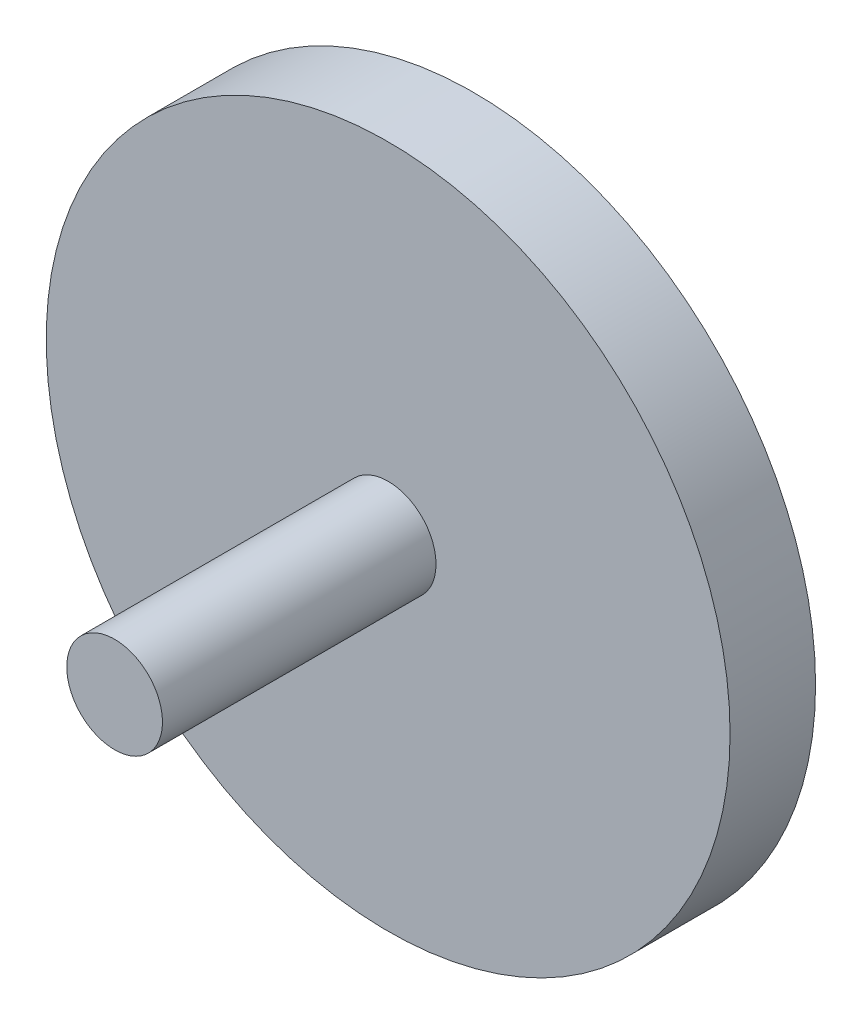
ISO-10303-21;
HEADER;
FILE_DESCRIPTION(('STEP AP214'),'2;1');
FILE_NAME('part.step','',(''),(''),'','','');
FILE_SCHEMA(('AUTOMOTIVE_DESIGN { 1 0 10303 214 1 1 1 1 }'));
ENDSEC;
DATA;
#1=APPLICATION_CONTEXT('core data for automotive mechanical design processes');
#2=APPLICATION_PROTOCOL_DEFINITION('international standard','automotive_design',2000,#1);
#3=PRODUCT_CONTEXT('',#1,'mechanical');
#4=PRODUCT('Part','Part','',(#3));
#5=PRODUCT_RELATED_PRODUCT_CATEGORY('part','',(#4));
#6=PRODUCT_DEFINITION_FORMATION('','',#4);
#7=PRODUCT_DEFINITION_CONTEXT('part definition',#1,'design');
#8=PRODUCT_DEFINITION('design','',#6,#7);
#9=PRODUCT_DEFINITION_SHAPE('','',#8);
#10=(LENGTH_UNIT() NAMED_UNIT(*) SI_UNIT(.MILLI.,.METRE.));
#11=(NAMED_UNIT(*) PLANE_ANGLE_UNIT() SI_UNIT($,.RADIAN.));
#12=(NAMED_UNIT(*) SI_UNIT($,.STERADIAN.) SOLID_ANGLE_UNIT());
#13=UNCERTAINTY_MEASURE_WITH_UNIT(LENGTH_MEASURE(1.E-05),#10,'distance_accuracy_value','');
#14=(GEOMETRIC_REPRESENTATION_CONTEXT(3) GLOBAL_UNCERTAINTY_ASSIGNED_CONTEXT((#13)) GLOBAL_UNIT_ASSIGNED_CONTEXT((#10,
#11,#12)) REPRESENTATION_CONTEXT('',''));
#15=CARTESIAN_POINT('',(0.,0.,0.));
#16=DIRECTION('',(0.,0.,1.));
#17=DIRECTION('',(1.,0.,0.));
#18=AXIS2_PLACEMENT_3D('',#15,#16,#17);
#19=CARTESIAN_POINT('',(0.,0.,25.));
#20=DIRECTION('',(0.,0.,-1.));
#21=DIRECTION('',(-1.,0.,0.));
#22=AXIS2_PLACEMENT_3D('',#19,#20,#21);
#23=CYLINDRICAL_SURFACE('',#22,100.);
#24=CARTESIAN_POINT('',(0.,0.,25.));
#25=DIRECTION('',(0.,0.,1.));
#26=DIRECTION('',(1.,0.,0.));
#27=AXIS2_PLACEMENT_3D('',#24,#25,#26);
#28=CIRCLE('',#27,100.);
#29=CARTESIAN_POINT('',(100.,0.,25.));
#30=VERTEX_POINT('',#29);
#31=EDGE_CURVE('E10',#30,#30,#28,.T.);
#32=ORIENTED_EDGE('',*,*,#31,.F.);
#33=EDGE_LOOP('',(#32));
#34=FACE_BOUND('',#33,.T.);
#35=CARTESIAN_POINT('',(0.,0.,0.));
#36=DIRECTION('',(0.,0.,1.));
#37=DIRECTION('',(1.,0.,0.));
#38=AXIS2_PLACEMENT_3D('',#35,#36,#37);
#39=CIRCLE('',#38,100.);
#40=CARTESIAN_POINT('',(100.,0.,0.));
#41=VERTEX_POINT('',#40);
#42=EDGE_CURVE('E40',#41,#41,#39,.T.);
#43=ORIENTED_EDGE('',*,*,#42,.T.);
#44=EDGE_LOOP('',(#43));
#45=FACE_BOUND('',#44,.T.);
#46=ADVANCED_FACE('F37',(#34,#45),#23,.T.);
#47=CARTESIAN_POINT('',(0.,0.,25.));
#48=DIRECTION('',(0.,0.,1.));
#49=DIRECTION('',(1.,0.,0.));
#50=AXIS2_PLACEMENT_3D('',#47,#48,#49);
#51=PLANE('',#50);
#52=CARTESIAN_POINT('',(0.,0.,25.));
#53=DIRECTION('',(0.,0.,1.));
#54=DIRECTION('',(1.,0.,0.));
#55=AXIS2_PLACEMENT_3D('',#52,#53,#54);
#56=CIRCLE('',#55,14.);
#57=CARTESIAN_POINT('',(14.,0.,25.));
#58=VERTEX_POINT('',#57);
#59=EDGE_CURVE('E51',#58,#58,#56,.T.);
#60=ORIENTED_EDGE('',*,*,#59,.F.);
#61=EDGE_LOOP('',(#60));
#62=FACE_BOUND('',#61,.T.);
#63=ORIENTED_EDGE('',*,*,#31,.T.);
#64=EDGE_LOOP('',(#63));
#65=FACE_BOUND('',#64,.T.);
#66=ADVANCED_FACE('F80',(#62,#65),#51,.T.);
#67=CARTESIAN_POINT('',(0.,0.,0.));
#68=DIRECTION('',(0.,0.,1.));
#69=DIRECTION('',(1.,0.,0.));
#70=AXIS2_PLACEMENT_3D('',#67,#68,#69);
#71=PLANE('',#70);
#72=CARTESIAN_POINT('',(0.,50.,0.));
#73=DIRECTION('',(0.,0.,-1.));
#74=DIRECTION('',(-1.,0.,0.));
#75=AXIS2_PLACEMENT_3D('',#72,#73,#74);
#76=CIRCLE('',#75,10.);
#77=CARTESIAN_POINT('',(-10.,50.,0.));
#78=VERTEX_POINT('',#77);
#79=EDGE_CURVE('E59',#78,#78,#76,.T.);
#80=ORIENTED_EDGE('',*,*,#79,.F.);
#81=EDGE_LOOP('',(#80));
#82=FACE_BOUND('',#81,.T.);
#83=ORIENTED_EDGE('',*,*,#42,.F.);
#84=EDGE_LOOP('',(#83));
#85=FACE_BOUND('',#84,.T.);
#86=ADVANCED_FACE('F76',(#82,#85),#71,.F.);
#87=CARTESIAN_POINT('',(0.,0.,105.));
#88=DIRECTION('',(0.,0.,-1.));
#89=DIRECTION('',(-1.,0.,0.));
#90=AXIS2_PLACEMENT_3D('',#87,#88,#89);
#91=CYLINDRICAL_SURFACE('',#90,14.);
#92=CARTESIAN_POINT('',(0.,0.,105.));
#93=DIRECTION('',(0.,0.,1.));
#94=DIRECTION('',(1.,0.,0.));
#95=AXIS2_PLACEMENT_3D('',#92,#93,#94);
#96=CIRCLE('',#95,14.);
#97=CARTESIAN_POINT('',(14.,0.,105.));
#98=VERTEX_POINT('',#97);
#99=EDGE_CURVE('E49',#98,#98,#96,.T.);
#100=ORIENTED_EDGE('',*,*,#99,.F.);
#101=EDGE_LOOP('',(#100));
#102=FACE_BOUND('',#101,.T.);
#103=ORIENTED_EDGE('',*,*,#59,.T.);
#104=EDGE_LOOP('',(#103));
#105=FACE_BOUND('',#104,.T.);
#106=ADVANCED_FACE('F79',(#102,#105),#91,.T.);
#107=CARTESIAN_POINT('',(0.,0.,105.));
#108=DIRECTION('',(0.,0.,1.));
#109=DIRECTION('',(1.,0.,0.));
#110=AXIS2_PLACEMENT_3D('',#107,#108,#109);
#111=PLANE('',#110);
#112=ORIENTED_EDGE('',*,*,#99,.T.);
#113=EDGE_LOOP('',(#112));
#114=FACE_BOUND('',#113,.T.);
#115=ADVANCED_FACE('F72',(#114),#111,.T.);
#116=CARTESIAN_POINT('',(0.,50.,4.));
#117=DIRECTION('',(0.,0.,-1.));
#118=DIRECTION('',(-1.,0.,0.));
#119=AXIS2_PLACEMENT_3D('',#116,#117,#118);
#120=CYLINDRICAL_SURFACE('',#119,10.);
#121=CARTESIAN_POINT('',(0.,50.,4.));
#122=DIRECTION('',(0.,0.,-1.));
#123=DIRECTION('',(-1.,0.,0.));
#124=AXIS2_PLACEMENT_3D('',#121,#122,#123);
#125=CIRCLE('',#124,10.);
#126=CARTESIAN_POINT('',(-10.,50.,4.));
#127=VERTEX_POINT('',#126);
#128=EDGE_CURVE('E55',#127,#127,#125,.T.);
#129=ORIENTED_EDGE('',*,*,#128,.F.);
#130=EDGE_LOOP('',(#129));
#131=FACE_BOUND('',#130,.T.);
#132=ORIENTED_EDGE('',*,*,#79,.T.);
#133=EDGE_LOOP('',(#132));
#134=FACE_BOUND('',#133,.T.);
#135=ADVANCED_FACE('F69',(#131,#134),#120,.F.);
#136=CARTESIAN_POINT('',(0.,50.,4.));
#137=DIRECTION('',(0.,0.,-1.));
#138=DIRECTION('',(-1.,0.,0.));
#139=AXIS2_PLACEMENT_3D('',#136,#137,#138);
#140=PLANE('',#139);
#141=ORIENTED_EDGE('',*,*,#128,.T.);
#142=EDGE_LOOP('',(#141));
#143=FACE_BOUND('',#142,.T.);
#144=ADVANCED_FACE('F67',(#143),#140,.T.);
#145=CLOSED_SHELL('',(#46,#66,#86,#106,#115,#135,#144));
#146=MANIFOLD_SOLID_BREP('B2',#145);
#147=ADVANCED_BREP_SHAPE_REPRESENTATION('',(#18,#146),#14);
#148=SHAPE_DEFINITION_REPRESENTATION(#9,#147);
ENDSEC;
END-ISO-10303-21;
